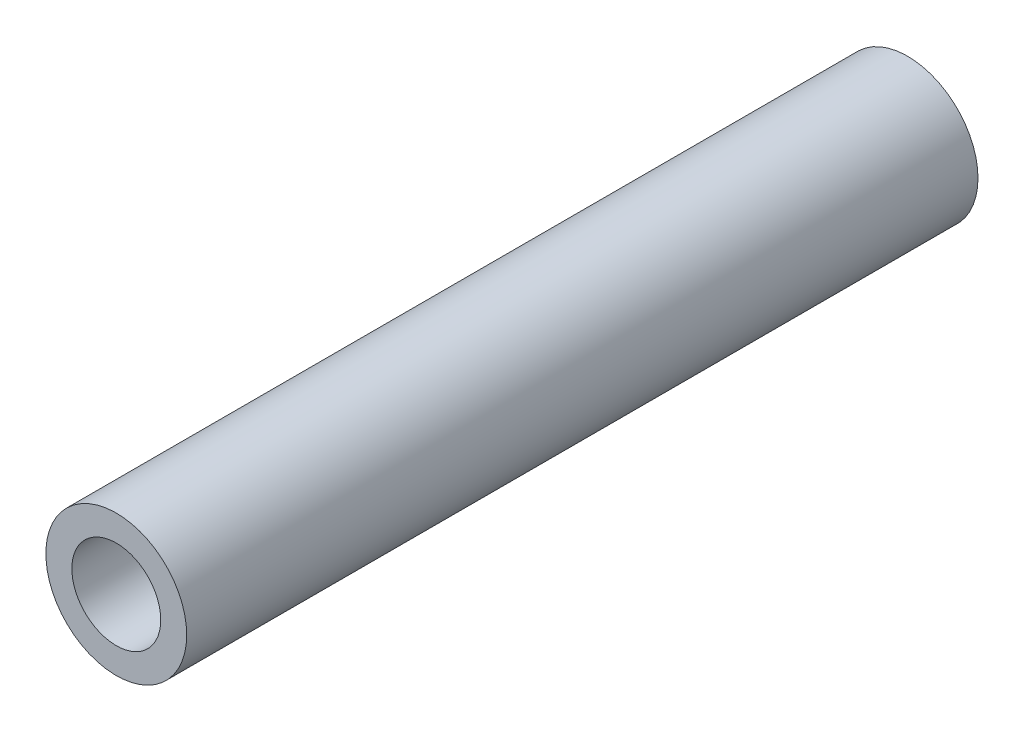
ISO-10303-21;
HEADER;
FILE_DESCRIPTION(('STEP AP214'),'2;1');
FILE_NAME('part.step','',(''),(''),'','','');
FILE_SCHEMA(('AUTOMOTIVE_DESIGN { 1 0 10303 214 1 1 1 1 }'));
ENDSEC;
DATA;
#1=APPLICATION_CONTEXT('core data for automotive mechanical design processes');
#2=APPLICATION_PROTOCOL_DEFINITION('international standard','automotive_design',2000,#1);
#3=PRODUCT_CONTEXT('',#1,'mechanical');
#4=PRODUCT('Part','Part','',(#3));
#5=PRODUCT_RELATED_PRODUCT_CATEGORY('part','',(#4));
#6=PRODUCT_DEFINITION_FORMATION('','',#4);
#7=PRODUCT_DEFINITION_CONTEXT('part definition',#1,'design');
#8=PRODUCT_DEFINITION('design','',#6,#7);
#9=PRODUCT_DEFINITION_SHAPE('','',#8);
#10=(LENGTH_UNIT() NAMED_UNIT(*) SI_UNIT(.MILLI.,.METRE.));
#11=(NAMED_UNIT(*) PLANE_ANGLE_UNIT() SI_UNIT($,.RADIAN.));
#12=(NAMED_UNIT(*) SI_UNIT($,.STERADIAN.) SOLID_ANGLE_UNIT());
#13=UNCERTAINTY_MEASURE_WITH_UNIT(LENGTH_MEASURE(1.E-05),#10,'distance_accuracy_value','');
#14=(GEOMETRIC_REPRESENTATION_CONTEXT(3) GLOBAL_UNCERTAINTY_ASSIGNED_CONTEXT((#13)) GLOBAL_UNIT_ASSIGNED_CONTEXT((#10,
#11,#12)) REPRESENTATION_CONTEXT('',''));
#15=CARTESIAN_POINT('',(0.,0.,0.));
#16=DIRECTION('',(0.,0.,1.));
#17=DIRECTION('',(1.,0.,0.));
#18=AXIS2_PLACEMENT_3D('',#15,#16,#17);
#19=CARTESIAN_POINT('',(0.,0.,60.96));
#20=DIRECTION('',(0.,0.,1.));
#21=DIRECTION('',(1.,0.,0.));
#22=AXIS2_PLACEMENT_3D('',#19,#20,#21);
#23=PLANE('',#22);
#24=CARTESIAN_POINT('',(0.,0.,60.96));
#25=DIRECTION('',(0.,0.,1.));
#26=DIRECTION('',(1.,0.,0.));
#27=AXIS2_PLACEMENT_3D('',#24,#25,#26);
#28=CIRCLE('',#27,5.425);
#29=CARTESIAN_POINT('',(5.425,0.,60.96));
#30=VERTEX_POINT('',#29);
#31=EDGE_CURVE('E10',#30,#30,#28,.T.);
#32=ORIENTED_EDGE('',*,*,#31,.T.);
#33=EDGE_LOOP('',(#32));
#34=FACE_BOUND('',#33,.T.);
#35=CARTESIAN_POINT('',(0.,0.,60.96));
#36=DIRECTION('',(0.,0.,1.));
#37=DIRECTION('',(1.,0.,0.));
#38=AXIS2_PLACEMENT_3D('',#35,#36,#37);
#39=CIRCLE('',#38,3.425);
#40=CARTESIAN_POINT('',(3.425,0.,60.96));
#41=VERTEX_POINT('',#40);
#42=EDGE_CURVE('E50',#41,#41,#39,.T.);
#43=ORIENTED_EDGE('',*,*,#42,.F.);
#44=EDGE_LOOP('',(#43));
#45=FACE_BOUND('',#44,.T.);
#46=ADVANCED_FACE('F37',(#34,#45),#23,.T.);
#47=CARTESIAN_POINT('',(0.,0.,0.));
#48=DIRECTION('',(0.,0.,1.));
#49=DIRECTION('',(1.,0.,0.));
#50=AXIS2_PLACEMENT_3D('',#47,#48,#49);
#51=PLANE('',#50);
#52=CARTESIAN_POINT('',(0.,0.,0.));
#53=DIRECTION('',(0.,0.,1.));
#54=DIRECTION('',(1.,0.,0.));
#55=AXIS2_PLACEMENT_3D('',#52,#53,#54);
#56=CIRCLE('',#55,5.425);
#57=CARTESIAN_POINT('',(5.425,0.,0.));
#58=VERTEX_POINT('',#57);
#59=EDGE_CURVE('E41',#58,#58,#56,.T.);
#60=ORIENTED_EDGE('',*,*,#59,.F.);
#61=EDGE_LOOP('',(#60));
#62=FACE_BOUND('',#61,.T.);
#63=CARTESIAN_POINT('',(0.,0.,0.));
#64=DIRECTION('',(0.,0.,1.));
#65=DIRECTION('',(1.,0.,0.));
#66=AXIS2_PLACEMENT_3D('',#63,#64,#65);
#67=CIRCLE('',#66,3.425);
#68=CARTESIAN_POINT('',(3.425,0.,0.));
#69=VERTEX_POINT('',#68);
#70=EDGE_CURVE('E52',#69,#69,#67,.T.);
#71=ORIENTED_EDGE('',*,*,#70,.T.);
#72=EDGE_LOOP('',(#71));
#73=FACE_BOUND('',#72,.T.);
#74=ADVANCED_FACE('F64',(#62,#73),#51,.F.);
#75=CARTESIAN_POINT('',(0.,0.,60.96));
#76=DIRECTION('',(0.,0.,-1.));
#77=DIRECTION('',(-1.,0.,0.));
#78=AXIS2_PLACEMENT_3D('',#75,#76,#77);
#79=CYLINDRICAL_SURFACE('',#78,5.425);
#80=ORIENTED_EDGE('',*,*,#31,.F.);
#81=EDGE_LOOP('',(#80));
#82=FACE_BOUND('',#81,.T.);
#83=ORIENTED_EDGE('',*,*,#59,.T.);
#84=EDGE_LOOP('',(#83));
#85=FACE_BOUND('',#84,.T.);
#86=ADVANCED_FACE('F39',(#82,#85),#79,.T.);
#87=CARTESIAN_POINT('',(0.,0.,60.96));
#88=DIRECTION('',(0.,0.,-1.));
#89=DIRECTION('',(-1.,0.,0.));
#90=AXIS2_PLACEMENT_3D('',#87,#88,#89);
#91=CYLINDRICAL_SURFACE('',#90,3.425);
#92=ORIENTED_EDGE('',*,*,#42,.T.);
#93=EDGE_LOOP('',(#92));
#94=FACE_BOUND('',#93,.T.);
#95=ORIENTED_EDGE('',*,*,#70,.F.);
#96=EDGE_LOOP('',(#95));
#97=FACE_BOUND('',#96,.T.);
#98=ADVANCED_FACE('F60',(#94,#97),#91,.F.);
#99=CLOSED_SHELL('',(#46,#74,#86,#98));
#100=MANIFOLD_SOLID_BREP('B2',#99);
#101=ADVANCED_BREP_SHAPE_REPRESENTATION('',(#18,#100),#14);
#102=SHAPE_DEFINITION_REPRESENTATION(#9,#101);
ENDSEC;
END-ISO-10303-21;
